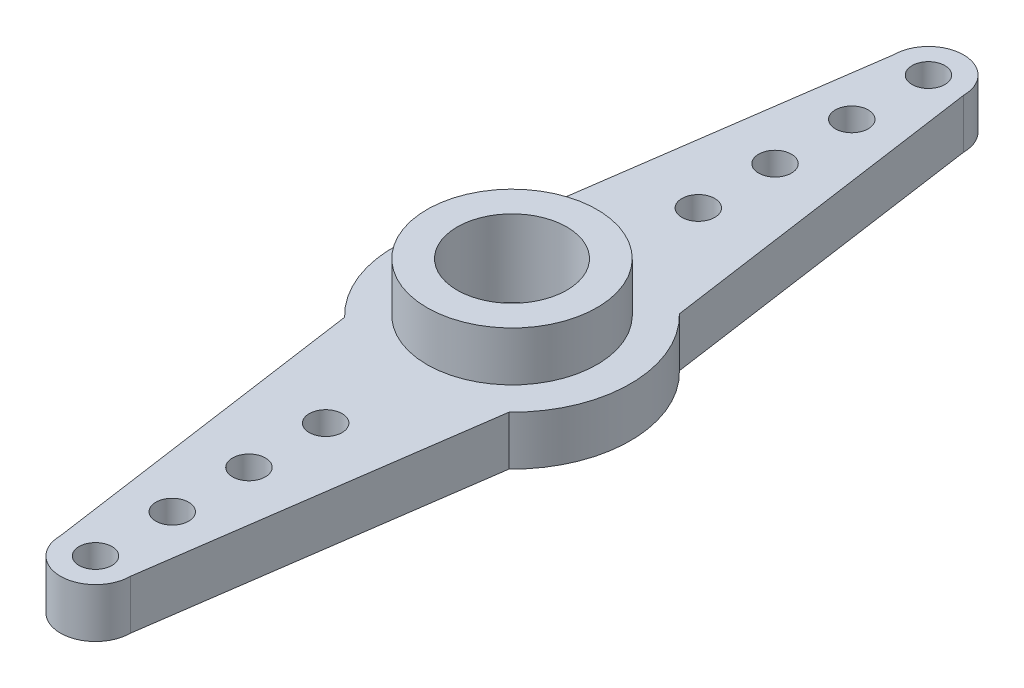
ISO-10303-21;
HEADER;
FILE_DESCRIPTION(('STEP AP214'),'2;1');
FILE_NAME('part.step','',(''),(''),'','','');
FILE_SCHEMA(('AUTOMOTIVE_DESIGN { 1 0 10303 214 1 1 1 1 }'));
ENDSEC;
DATA;
#1=APPLICATION_CONTEXT('core data for automotive mechanical design processes');
#2=APPLICATION_PROTOCOL_DEFINITION('international standard','automotive_design',2000,#1);
#3=PRODUCT_CONTEXT('',#1,'mechanical');
#4=PRODUCT('Part','Part','',(#3));
#5=PRODUCT_RELATED_PRODUCT_CATEGORY('part','',(#4));
#6=PRODUCT_DEFINITION_FORMATION('','',#4);
#7=PRODUCT_DEFINITION_CONTEXT('part definition',#1,'design');
#8=PRODUCT_DEFINITION('design','',#6,#7);
#9=PRODUCT_DEFINITION_SHAPE('','',#8);
#10=(LENGTH_UNIT() NAMED_UNIT(*) SI_UNIT(.MILLI.,.METRE.));
#11=(NAMED_UNIT(*) PLANE_ANGLE_UNIT() SI_UNIT($,.RADIAN.));
#12=(NAMED_UNIT(*) SI_UNIT($,.STERADIAN.) SOLID_ANGLE_UNIT());
#13=UNCERTAINTY_MEASURE_WITH_UNIT(LENGTH_MEASURE(1.E-05),#10,'distance_accuracy_value','');
#14=(GEOMETRIC_REPRESENTATION_CONTEXT(3) GLOBAL_UNCERTAINTY_ASSIGNED_CONTEXT((#13)) GLOBAL_UNIT_ASSIGNED_CONTEXT((#10,
#11,#12)) REPRESENTATION_CONTEXT('',''));
#15=CARTESIAN_POINT('',(0.,0.,0.));
#16=DIRECTION('',(0.,0.,1.));
#17=DIRECTION('',(1.,0.,0.));
#18=AXIS2_PLACEMENT_3D('',#15,#16,#17);
#19=CARTESIAN_POINT('',(0.,0.,0.));
#20=DIRECTION('',(0.,1.,0.));
#21=DIRECTION('',(0.,0.,1.));
#22=AXIS2_PLACEMENT_3D('',#19,#20,#21);
#23=PLANE('',#22);
#24=CARTESIAN_POINT('',(0.,0.,0.));
#25=DIRECTION('',(0.,-1.,0.));
#26=DIRECTION('',(0.,0.,-1.));
#27=AXIS2_PLACEMENT_3D('',#24,#25,#26);
#28=CIRCLE('',#27,2.00852796678638);
#29=CARTESIAN_POINT('',(0.,0.,-2.00852796678638));
#30=VERTEX_POINT('',#29);
#31=EDGE_CURVE('E257',#30,#30,#28,.T.);
#32=ORIENTED_EDGE('',*,*,#31,.F.);
#33=EDGE_LOOP('',(#32));
#34=FACE_BOUND('',#33,.T.);
#35=CARTESIAN_POINT('',(0.,0.,0.));
#36=DIRECTION('',(0.,-1.,0.));
#37=DIRECTION('',(0.,0.,-1.));
#38=AXIS2_PLACEMENT_3D('',#35,#36,#37);
#39=CIRCLE('',#38,3.);
#40=CARTESIAN_POINT('',(0.,0.,-3.));
#41=VERTEX_POINT('',#40);
#42=EDGE_CURVE('E269',#41,#41,#39,.T.);
#43=ORIENTED_EDGE('',*,*,#42,.T.);
#44=EDGE_LOOP('',(#43));
#45=FACE_BOUND('',#44,.T.);
#46=ADVANCED_FACE('F50',(#34,#45),#23,.F.);
#47=CARTESIAN_POINT('',(0.,2.25,0.));
#48=DIRECTION('',(0.,-1.,0.));
#49=DIRECTION('',(0.,0.,-1.));
#50=AXIS2_PLACEMENT_3D('',#47,#48,#49);
#51=CYLINDRICAL_SURFACE('',#50,2.5);
#52=CARTESIAN_POINT('',(0.,4.5,0.));
#53=DIRECTION('',(0.,1.,0.));
#54=DIRECTION('',(0.,0.,1.));
#55=AXIS2_PLACEMENT_3D('',#52,#53,#54);
#56=CIRCLE('',#55,2.5);
#57=CARTESIAN_POINT('',(0.,4.5,2.5));
#58=VERTEX_POINT('',#57);
#59=EDGE_CURVE('E248',#58,#58,#56,.T.);
#60=ORIENTED_EDGE('',*,*,#59,.T.);
#61=EDGE_LOOP('',(#60));
#62=FACE_BOUND('',#61,.T.);
#63=CARTESIAN_POINT('',(0.,1.,0.));
#64=DIRECTION('',(0.,-1.,0.));
#65=DIRECTION('',(0.,0.,-1.));
#66=AXIS2_PLACEMENT_3D('',#63,#64,#65);
#67=CIRCLE('',#66,2.5);
#68=CARTESIAN_POINT('',(0.,1.,-2.5));
#69=VERTEX_POINT('',#68);
#70=EDGE_CURVE('E253',#69,#69,#67,.T.);
#71=ORIENTED_EDGE('',*,*,#70,.T.);
#72=EDGE_LOOP('',(#71));
#73=FACE_BOUND('',#72,.T.);
#74=ADVANCED_FACE('F299',(#62,#73),#51,.F.);
#75=CARTESIAN_POINT('',(0.,2.25,0.));
#76=DIRECTION('',(0.,1.,0.));
#77=DIRECTION('',(0.,0.,1.));
#78=AXIS2_PLACEMENT_3D('',#75,#76,#77);
#79=PLANE('',#78);
#80=CARTESIAN_POINT('',(0.,2.25,8.5));
#81=DIRECTION('',(0.,1.,0.));
#82=DIRECTION('',(0.,0.,1.));
#83=AXIS2_PLACEMENT_3D('',#80,#81,#82);
#84=CIRCLE('',#83,0.75);
#85=CARTESIAN_POINT('',(0.,2.25,9.25));
#86=VERTEX_POINT('',#85);
#87=EDGE_CURVE('E236',#86,#86,#84,.T.);
#88=ORIENTED_EDGE('',*,*,#87,.F.);
#89=EDGE_LOOP('',(#88));
#90=FACE_BOUND('',#89,.T.);
#91=CARTESIAN_POINT('',(0.,2.25,15.5));
#92=DIRECTION('',(0.,1.,0.));
#93=DIRECTION('',(0.,0.,1.));
#94=AXIS2_PLACEMENT_3D('',#91,#92,#93);
#95=CIRCLE('',#94,0.750000000000001);
#96=CARTESIAN_POINT('',(0.,2.25,16.25));
#97=VERTEX_POINT('',#96);
#98=EDGE_CURVE('E224',#97,#97,#95,.T.);
#99=ORIENTED_EDGE('',*,*,#98,.F.);
#100=EDGE_LOOP('',(#99));
#101=FACE_BOUND('',#100,.T.);
#102=CARTESIAN_POINT('',(0.,2.25,-12.));
#103=DIRECTION('',(0.,1.,0.));
#104=DIRECTION('',(0.,0.,1.));
#105=AXIS2_PLACEMENT_3D('',#102,#103,#104);
#106=CIRCLE('',#105,0.75);
#107=CARTESIAN_POINT('',(0.,2.25,-11.25));
#108=VERTEX_POINT('',#107);
#109=EDGE_CURVE('E212',#108,#108,#106,.T.);
#110=ORIENTED_EDGE('',*,*,#109,.F.);
#111=EDGE_LOOP('',(#110));
#112=FACE_BOUND('',#111,.T.);
#113=CARTESIAN_POINT('',(0.,2.25,-19.));
#114=DIRECTION('',(0.,1.,0.));
#115=DIRECTION('',(0.,0.,1.));
#116=AXIS2_PLACEMENT_3D('',#113,#114,#115);
#117=CIRCLE('',#116,0.75);
#118=CARTESIAN_POINT('',(0.,2.25,-18.25));
#119=VERTEX_POINT('',#118);
#120=EDGE_CURVE('E200',#119,#119,#117,.T.);
#121=ORIENTED_EDGE('',*,*,#120,.F.);
#122=EDGE_LOOP('',(#121));
#123=FACE_BOUND('',#122,.T.);
#124=CARTESIAN_POINT('',(0.,2.25,0.));
#125=DIRECTION('',(0.,1.,0.));
#126=DIRECTION('',(0.,0.,1.));
#127=AXIS2_PLACEMENT_3D('',#124,#125,#126);
#128=CIRCLE('',#127,5.4);
#129=CARTESIAN_POINT('',(-3.75,2.25,-3.88555015409659));
#130=VERTEX_POINT('',#129);
#131=CARTESIAN_POINT('',(-3.75,2.25,3.88555015409659));
#132=VERTEX_POINT('',#131);
#133=EDGE_CURVE('E163',#130,#132,#128,.T.);
#134=ORIENTED_EDGE('',*,*,#133,.T.);
#135=DIRECTION('',(0.140830303687938,0.,0.990033749709152));
#136=VECTOR('',#135,1.);
#137=CARTESIAN_POINT('',(-3.75,2.25,3.88555015409659));
#138=LINE('',#137,#136);
#139=CARTESIAN_POINT('',(-1.6,2.25,19.));
#140=VERTEX_POINT('',#139);
#141=EDGE_CURVE('E110',#132,#140,#138,.T.);
#142=ORIENTED_EDGE('',*,*,#141,.T.);
#143=CARTESIAN_POINT('',(0.,2.25,19.));
#144=DIRECTION('',(0.,1.,0.));
#145=DIRECTION('',(0.,0.,1.));
#146=AXIS2_PLACEMENT_3D('',#143,#144,#145);
#147=CIRCLE('',#146,1.6);
#148=CARTESIAN_POINT('',(1.6,2.25,19.));
#149=VERTEX_POINT('',#148);
#150=EDGE_CURVE('E178',#140,#149,#147,.T.);
#151=ORIENTED_EDGE('',*,*,#150,.T.);
#152=DIRECTION('',(0.140830303687937,0.,-0.990033749709152));
#153=VECTOR('',#152,1.);
#154=CARTESIAN_POINT('',(1.6,2.25,19.));
#155=LINE('',#154,#153);
#156=CARTESIAN_POINT('',(3.75,2.25,3.88555015409659));
#157=VERTEX_POINT('',#156);
#158=EDGE_CURVE('E191',#149,#157,#155,.T.);
#159=ORIENTED_EDGE('',*,*,#158,.T.);
#160=CARTESIAN_POINT('',(0.,2.25,0.));
#161=DIRECTION('',(0.,1.,0.));
#162=DIRECTION('',(0.,0.,1.));
#163=AXIS2_PLACEMENT_3D('',#160,#161,#162);
#164=CIRCLE('',#163,5.4);
#165=CARTESIAN_POINT('',(3.75,2.25,-3.88555015409659));
#166=VERTEX_POINT('',#165);
#167=EDGE_CURVE('E130',#157,#166,#164,.T.);
#168=ORIENTED_EDGE('',*,*,#167,.T.);
#169=DIRECTION('',(-0.140830303687937,0.,-0.990033749709152));
#170=VECTOR('',#169,1.);
#171=CARTESIAN_POINT('',(1.6,2.25,-19.));
#172=LINE('',#171,#170);
#173=CARTESIAN_POINT('',(1.6,2.25,-19.));
#174=VERTEX_POINT('',#173);
#175=EDGE_CURVE('E123',#166,#174,#172,.T.);
#176=ORIENTED_EDGE('',*,*,#175,.T.);
#177=CARTESIAN_POINT('',(0.,2.25,-19.));
#178=DIRECTION('',(0.,1.,0.));
#179=DIRECTION('',(0.,0.,1.));
#180=AXIS2_PLACEMENT_3D('',#177,#178,#179);
#181=CIRCLE('',#180,1.6);
#182=CARTESIAN_POINT('',(-1.6,2.25,-19.));
#183=VERTEX_POINT('',#182);
#184=EDGE_CURVE('E128',#174,#183,#181,.T.);
#185=ORIENTED_EDGE('',*,*,#184,.T.);
#186=DIRECTION('',(-0.140830303687937,0.,0.990033749709152));
#187=VECTOR('',#186,1.);
#188=CARTESIAN_POINT('',(-1.6,2.25,-19.));
#189=LINE('',#188,#187);
#190=EDGE_CURVE('E67',#183,#130,#189,.T.);
#191=ORIENTED_EDGE('',*,*,#190,.T.);
#192=EDGE_LOOP('',(#134,#142,#151,#159,#168,#176,#185,#191));
#193=FACE_BOUND('',#192,.T.);
#194=CARTESIAN_POINT('',(0.,2.25,19.));
#195=DIRECTION('',(0.,1.,0.));
#196=DIRECTION('',(0.,0.,1.));
#197=AXIS2_PLACEMENT_3D('',#194,#195,#196);
#198=CIRCLE('',#197,0.75);
#199=CARTESIAN_POINT('',(0.,2.25,19.75));
#200=VERTEX_POINT('',#199);
#201=EDGE_CURVE('E152',#200,#200,#198,.T.);
#202=ORIENTED_EDGE('',*,*,#201,.F.);
#203=EDGE_LOOP('',(#202));
#204=FACE_BOUND('',#203,.T.);
#205=CARTESIAN_POINT('',(0.,2.25,-15.5));
#206=DIRECTION('',(0.,1.,0.));
#207=DIRECTION('',(0.,0.,1.));
#208=AXIS2_PLACEMENT_3D('',#205,#206,#207);
#209=CIRCLE('',#208,0.75);
#210=CARTESIAN_POINT('',(0.,2.25,-14.75));
#211=VERTEX_POINT('',#210);
#212=EDGE_CURVE('E206',#211,#211,#209,.T.);
#213=ORIENTED_EDGE('',*,*,#212,.F.);
#214=EDGE_LOOP('',(#213));
#215=FACE_BOUND('',#214,.T.);
#216=CARTESIAN_POINT('',(0.,2.25,-8.5));
#217=DIRECTION('',(0.,1.,0.));
#218=DIRECTION('',(0.,0.,1.));
#219=AXIS2_PLACEMENT_3D('',#216,#217,#218);
#220=CIRCLE('',#219,0.75);
#221=CARTESIAN_POINT('',(0.,2.25,-7.75));
#222=VERTEX_POINT('',#221);
#223=EDGE_CURVE('E218',#222,#222,#220,.T.);
#224=ORIENTED_EDGE('',*,*,#223,.F.);
#225=EDGE_LOOP('',(#224));
#226=FACE_BOUND('',#225,.T.);
#227=CARTESIAN_POINT('',(0.,2.25,12.));
#228=DIRECTION('',(0.,1.,0.));
#229=DIRECTION('',(0.,0.,1.));
#230=AXIS2_PLACEMENT_3D('',#227,#228,#229);
#231=CIRCLE('',#230,0.750000000000001);
#232=CARTESIAN_POINT('',(0.,2.25,12.75));
#233=VERTEX_POINT('',#232);
#234=EDGE_CURVE('E230',#233,#233,#231,.T.);
#235=ORIENTED_EDGE('',*,*,#234,.F.);
#236=EDGE_LOOP('',(#235));
#237=FACE_BOUND('',#236,.T.);
#238=CARTESIAN_POINT('',(0.,2.25,0.));
#239=DIRECTION('',(0.,1.,0.));
#240=DIRECTION('',(0.,0.,1.));
#241=AXIS2_PLACEMENT_3D('',#238,#239,#240);
#242=CIRCLE('',#241,3.87950189537483);
#243=CARTESIAN_POINT('',(0.,2.25,3.87950189537483));
#244=VERTEX_POINT('',#243);
#245=EDGE_CURVE('E245',#244,#244,#242,.T.);
#246=ORIENTED_EDGE('',*,*,#245,.F.);
#247=EDGE_LOOP('',(#246));
#248=FACE_BOUND('',#247,.T.);
#249=ADVANCED_FACE('F125',(#90,#101,#112,#123,#193,#204,#215,#226,#237,#248),#79,.T.);
#250=CARTESIAN_POINT('',(0.,0.,0.));
#251=DIRECTION('',(0.,-1.,0.));
#252=DIRECTION('',(0.,0.,-1.));
#253=AXIS2_PLACEMENT_3D('',#250,#251,#252);
#254=CIRCLE('',#253,3.8);
#255=CARTESIAN_POINT('',(0.,0.,-3.8));
#256=VERTEX_POINT('',#255);
#257=EDGE_CURVE('E263',#256,#256,#254,.T.);
#258=ORIENTED_EDGE('',*,*,#257,.F.);
#259=EDGE_LOOP('',(#258));
#260=FACE_BOUND('',#259,.T.);
#261=CARTESIAN_POINT('',(0.,0.,0.));
#262=DIRECTION('',(0.,1.,0.));
#263=DIRECTION('',(0.,0.,1.));
#264=AXIS2_PLACEMENT_3D('',#261,#262,#263);
#265=CIRCLE('',#264,5.4);
#266=CARTESIAN_POINT('',(-3.75,0.,-3.88555015409659));
#267=VERTEX_POINT('',#266);
#268=CARTESIAN_POINT('',(-3.75,0.,3.88555015409659));
#269=VERTEX_POINT('',#268);
#270=EDGE_CURVE('E148',#267,#269,#265,.T.);
#271=ORIENTED_EDGE('',*,*,#270,.F.);
#272=DIRECTION('',(-0.140830303687937,0.,0.990033749709152));
#273=VECTOR('',#272,1.);
#274=CARTESIAN_POINT('',(-1.6,0.,-19.));
#275=LINE('',#274,#273);
#276=CARTESIAN_POINT('',(-1.6,0.,-19.));
#277=VERTEX_POINT('',#276);
#278=EDGE_CURVE('E102',#277,#267,#275,.T.);
#279=ORIENTED_EDGE('',*,*,#278,.F.);
#280=CARTESIAN_POINT('',(0.,0.,-19.));
#281=DIRECTION('',(0.,1.,0.));
#282=DIRECTION('',(0.,0.,1.));
#283=AXIS2_PLACEMENT_3D('',#280,#281,#282);
#284=CIRCLE('',#283,1.6);
#285=CARTESIAN_POINT('',(1.6,0.,-19.));
#286=VERTEX_POINT('',#285);
#287=EDGE_CURVE('E96',#286,#277,#284,.T.);
#288=ORIENTED_EDGE('',*,*,#287,.F.);
#289=DIRECTION('',(-0.140830303687937,0.,-0.990033749709152));
#290=VECTOR('',#289,1.);
#291=CARTESIAN_POINT('',(1.6,0.,-19.));
#292=LINE('',#291,#290);
#293=CARTESIAN_POINT('',(3.75,0.,-3.88555015409659));
#294=VERTEX_POINT('',#293);
#295=EDGE_CURVE('E138',#294,#286,#292,.T.);
#296=ORIENTED_EDGE('',*,*,#295,.F.);
#297=CARTESIAN_POINT('',(0.,0.,0.));
#298=DIRECTION('',(0.,1.,0.));
#299=DIRECTION('',(0.,0.,1.));
#300=AXIS2_PLACEMENT_3D('',#297,#298,#299);
#301=CIRCLE('',#300,5.4);
#302=CARTESIAN_POINT('',(3.75,0.,3.88555015409659));
#303=VERTEX_POINT('',#302);
#304=EDGE_CURVE('E158',#303,#294,#301,.T.);
#305=ORIENTED_EDGE('',*,*,#304,.F.);
#306=DIRECTION('',(0.140830303687937,0.,-0.990033749709152));
#307=VECTOR('',#306,1.);
#308=CARTESIAN_POINT('',(1.6,0.,19.));
#309=LINE('',#308,#307);
#310=CARTESIAN_POINT('',(1.6,0.,19.));
#311=VERTEX_POINT('',#310);
#312=EDGE_CURVE('E156',#311,#303,#309,.T.);
#313=ORIENTED_EDGE('',*,*,#312,.F.);
#314=CARTESIAN_POINT('',(0.,0.,19.));
#315=DIRECTION('',(0.,1.,0.));
#316=DIRECTION('',(0.,0.,1.));
#317=AXIS2_PLACEMENT_3D('',#314,#315,#316);
#318=CIRCLE('',#317,1.6);
#319=CARTESIAN_POINT('',(-1.6,0.,19.));
#320=VERTEX_POINT('',#319);
#321=EDGE_CURVE('E154',#320,#311,#318,.T.);
#322=ORIENTED_EDGE('',*,*,#321,.F.);
#323=DIRECTION('',(0.140830303687938,0.,0.990033749709152));
#324=VECTOR('',#323,1.);
#325=CARTESIAN_POINT('',(-3.75,0.,3.88555015409659));
#326=LINE('',#325,#324);
#327=EDGE_CURVE('E151',#269,#320,#326,.T.);
#328=ORIENTED_EDGE('',*,*,#327,.F.);
#329=EDGE_LOOP('',(#271,#279,#288,#296,#305,#313,#322,#328));
#330=FACE_BOUND('',#329,.T.);
#331=CARTESIAN_POINT('',(0.,0.,19.));
#332=DIRECTION('',(0.,1.,0.));
#333=DIRECTION('',(0.,0.,1.));
#334=AXIS2_PLACEMENT_3D('',#331,#332,#333);
#335=CIRCLE('',#334,0.75);
#336=CARTESIAN_POINT('',(0.,0.,19.75));
#337=VERTEX_POINT('',#336);
#338=EDGE_CURVE('E197',#337,#337,#335,.T.);
#339=ORIENTED_EDGE('',*,*,#338,.T.);
#340=EDGE_LOOP('',(#339));
#341=FACE_BOUND('',#340,.T.);
#342=CARTESIAN_POINT('',(0.,0.,-19.));
#343=DIRECTION('',(0.,1.,0.));
#344=DIRECTION('',(0.,0.,1.));
#345=AXIS2_PLACEMENT_3D('',#342,#343,#344);
#346=CIRCLE('',#345,0.75);
#347=CARTESIAN_POINT('',(0.,0.,-18.25));
#348=VERTEX_POINT('',#347);
#349=EDGE_CURVE('E203',#348,#348,#346,.T.);
#350=ORIENTED_EDGE('',*,*,#349,.T.);
#351=EDGE_LOOP('',(#350));
#352=FACE_BOUND('',#351,.T.);
#353=CARTESIAN_POINT('',(0.,0.,-15.5));
#354=DIRECTION('',(0.,1.,0.));
#355=DIRECTION('',(0.,0.,1.));
#356=AXIS2_PLACEMENT_3D('',#353,#354,#355);
#357=CIRCLE('',#356,0.75);
#358=CARTESIAN_POINT('',(0.,0.,-14.75));
#359=VERTEX_POINT('',#358);
#360=EDGE_CURVE('E209',#359,#359,#357,.T.);
#361=ORIENTED_EDGE('',*,*,#360,.T.);
#362=EDGE_LOOP('',(#361));
#363=FACE_BOUND('',#362,.T.);
#364=CARTESIAN_POINT('',(0.,0.,-12.));
#365=DIRECTION('',(0.,1.,0.));
#366=DIRECTION('',(0.,0.,1.));
#367=AXIS2_PLACEMENT_3D('',#364,#365,#366);
#368=CIRCLE('',#367,0.75);
#369=CARTESIAN_POINT('',(0.,0.,-11.25));
#370=VERTEX_POINT('',#369);
#371=EDGE_CURVE('E215',#370,#370,#368,.T.);
#372=ORIENTED_EDGE('',*,*,#371,.T.);
#373=EDGE_LOOP('',(#372));
#374=FACE_BOUND('',#373,.T.);
#375=CARTESIAN_POINT('',(0.,0.,-8.5));
#376=DIRECTION('',(0.,1.,0.));
#377=DIRECTION('',(0.,0.,1.));
#378=AXIS2_PLACEMENT_3D('',#375,#376,#377);
#379=CIRCLE('',#378,0.75);
#380=CARTESIAN_POINT('',(0.,0.,-7.75));
#381=VERTEX_POINT('',#380);
#382=EDGE_CURVE('E221',#381,#381,#379,.T.);
#383=ORIENTED_EDGE('',*,*,#382,.T.);
#384=EDGE_LOOP('',(#383));
#385=FACE_BOUND('',#384,.T.);
#386=CARTESIAN_POINT('',(0.,0.,15.5));
#387=DIRECTION('',(0.,1.,0.));
#388=DIRECTION('',(0.,0.,1.));
#389=AXIS2_PLACEMENT_3D('',#386,#387,#388);
#390=CIRCLE('',#389,0.750000000000001);
#391=CARTESIAN_POINT('',(0.,0.,16.25));
#392=VERTEX_POINT('',#391);
#393=EDGE_CURVE('E227',#392,#392,#390,.T.);
#394=ORIENTED_EDGE('',*,*,#393,.T.);
#395=EDGE_LOOP('',(#394));
#396=FACE_BOUND('',#395,.T.);
#397=CARTESIAN_POINT('',(0.,0.,12.));
#398=DIRECTION('',(0.,1.,0.));
#399=DIRECTION('',(0.,0.,1.));
#400=AXIS2_PLACEMENT_3D('',#397,#398,#399);
#401=CIRCLE('',#400,0.750000000000001);
#402=CARTESIAN_POINT('',(0.,0.,12.75));
#403=VERTEX_POINT('',#402);
#404=EDGE_CURVE('E233',#403,#403,#401,.T.);
#405=ORIENTED_EDGE('',*,*,#404,.T.);
#406=EDGE_LOOP('',(#405));
#407=FACE_BOUND('',#406,.T.);
#408=CARTESIAN_POINT('',(0.,0.,8.5));
#409=DIRECTION('',(0.,1.,0.));
#410=DIRECTION('',(0.,0.,1.));
#411=AXIS2_PLACEMENT_3D('',#408,#409,#410);
#412=CIRCLE('',#411,0.75);
#413=CARTESIAN_POINT('',(0.,0.,9.25));
#414=VERTEX_POINT('',#413);
#415=EDGE_CURVE('E239',#414,#414,#412,.T.);
#416=ORIENTED_EDGE('',*,*,#415,.T.);
#417=EDGE_LOOP('',(#416));
#418=FACE_BOUND('',#417,.T.);
#419=ADVANCED_FACE('F182',(#260,#330,#341,#352,#363,#374,#385,#396,#407,#418),#23,.F.);
#420=CARTESIAN_POINT('',(0.,2.25,0.));
#421=DIRECTION('',(0.,-1.,0.));
#422=DIRECTION('',(0.,0.,-1.));
#423=AXIS2_PLACEMENT_3D('',#420,#421,#422);
#424=CYLINDRICAL_SURFACE('',#423,5.4);
#425=ORIENTED_EDGE('',*,*,#270,.T.);
#426=DIRECTION('',(0.,-1.,0.));
#427=VECTOR('',#426,1.);
#428=CARTESIAN_POINT('',(-3.75,2.25,3.88555015409659));
#429=LINE('',#428,#427);
#430=EDGE_CURVE('E13',#132,#269,#429,.T.);
#431=ORIENTED_EDGE('',*,*,#430,.F.);
#432=ORIENTED_EDGE('',*,*,#133,.F.);
#433=DIRECTION('',(0.,-1.,0.));
#434=VECTOR('',#433,1.);
#435=CARTESIAN_POINT('',(-3.75,2.25,-3.88555015409659));
#436=LINE('',#435,#434);
#437=EDGE_CURVE('E144',#130,#267,#436,.T.);
#438=ORIENTED_EDGE('',*,*,#437,.T.);
#439=EDGE_LOOP('',(#425,#431,#432,#438));
#440=FACE_BOUND('',#439,.T.);
#441=ADVANCED_FACE('F52',(#440),#424,.T.);
#442=CARTESIAN_POINT('',(-3.75,2.25,3.88555015409659));
#443=DIRECTION('',(0.990033749709152,0.,-0.140830303687938));
#444=DIRECTION('',(-0.140830303687938,0.,-0.990033749709152));
#445=AXIS2_PLACEMENT_3D('',#442,#443,#444);
#446=PLANE('',#445);
#447=ORIENTED_EDGE('',*,*,#327,.T.);
#448=DIRECTION('',(0.,-1.,0.));
#449=VECTOR('',#448,1.);
#450=CARTESIAN_POINT('',(-1.6,2.25,19.));
#451=LINE('',#450,#449);
#452=EDGE_CURVE('E59',#140,#320,#451,.T.);
#453=ORIENTED_EDGE('',*,*,#452,.F.);
#454=ORIENTED_EDGE('',*,*,#141,.F.);
#455=ORIENTED_EDGE('',*,*,#430,.T.);
#456=EDGE_LOOP('',(#447,#453,#454,#455));
#457=FACE_BOUND('',#456,.T.);
#458=ADVANCED_FACE('F297',(#457),#446,.F.);
#459=CARTESIAN_POINT('',(0.,2.25,19.));
#460=DIRECTION('',(0.,-1.,0.));
#461=DIRECTION('',(0.,0.,-1.));
#462=AXIS2_PLACEMENT_3D('',#459,#460,#461);
#463=CYLINDRICAL_SURFACE('',#462,1.6);
#464=ORIENTED_EDGE('',*,*,#321,.T.);
#465=DIRECTION('',(0.,-1.,0.));
#466=VECTOR('',#465,1.);
#467=CARTESIAN_POINT('',(1.6,2.25,19.));
#468=LINE('',#467,#466);
#469=EDGE_CURVE('E170',#149,#311,#468,.T.);
#470=ORIENTED_EDGE('',*,*,#469,.F.);
#471=ORIENTED_EDGE('',*,*,#150,.F.);
#472=ORIENTED_EDGE('',*,*,#452,.T.);
#473=EDGE_LOOP('',(#464,#470,#471,#472));
#474=FACE_BOUND('',#473,.T.);
#475=ADVANCED_FACE('F176',(#474),#463,.T.);
#476=CARTESIAN_POINT('',(1.6,2.25,19.));
#477=DIRECTION('',(-0.990033749709152,0.,-0.140830303687937));
#478=DIRECTION('',(-0.140830303687937,0.,0.990033749709152));
#479=AXIS2_PLACEMENT_3D('',#476,#477,#478);
#480=PLANE('',#479);
#481=ORIENTED_EDGE('',*,*,#312,.T.);
#482=DIRECTION('',(0.,-1.,0.));
#483=VECTOR('',#482,1.);
#484=CARTESIAN_POINT('',(3.75,2.25,3.88555015409659));
#485=LINE('',#484,#483);
#486=EDGE_CURVE('E167',#157,#303,#485,.T.);
#487=ORIENTED_EDGE('',*,*,#486,.F.);
#488=ORIENTED_EDGE('',*,*,#158,.F.);
#489=ORIENTED_EDGE('',*,*,#469,.T.);
#490=EDGE_LOOP('',(#481,#487,#488,#489));
#491=FACE_BOUND('',#490,.T.);
#492=ADVANCED_FACE('F187',(#491),#480,.F.);
#493=CARTESIAN_POINT('',(0.,2.25,0.));
#494=DIRECTION('',(0.,-1.,0.));
#495=DIRECTION('',(0.,0.,-1.));
#496=AXIS2_PLACEMENT_3D('',#493,#494,#495);
#497=CYLINDRICAL_SURFACE('',#496,5.4);
#498=ORIENTED_EDGE('',*,*,#304,.T.);
#499=DIRECTION('',(0.,-1.,0.));
#500=VECTOR('',#499,1.);
#501=CARTESIAN_POINT('',(3.75,2.25,-3.88555015409659));
#502=LINE('',#501,#500);
#503=EDGE_CURVE('E139',#166,#294,#502,.T.);
#504=ORIENTED_EDGE('',*,*,#503,.F.);
#505=ORIENTED_EDGE('',*,*,#167,.F.);
#506=ORIENTED_EDGE('',*,*,#486,.T.);
#507=EDGE_LOOP('',(#498,#504,#505,#506));
#508=FACE_BOUND('',#507,.T.);
#509=ADVANCED_FACE('F190',(#508),#497,.T.);
#510=CARTESIAN_POINT('',(1.6,2.25,-19.));
#511=DIRECTION('',(-0.990033749709152,0.,0.140830303687937));
#512=DIRECTION('',(0.140830303687937,0.,0.990033749709152));
#513=AXIS2_PLACEMENT_3D('',#510,#511,#512);
#514=PLANE('',#513);
#515=ORIENTED_EDGE('',*,*,#295,.T.);
#516=DIRECTION('',(0.,-1.,0.));
#517=VECTOR('',#516,1.);
#518=CARTESIAN_POINT('',(1.6,2.25,-19.));
#519=LINE('',#518,#517);
#520=EDGE_CURVE('E135',#174,#286,#519,.T.);
#521=ORIENTED_EDGE('',*,*,#520,.F.);
#522=ORIENTED_EDGE('',*,*,#175,.F.);
#523=ORIENTED_EDGE('',*,*,#503,.T.);
#524=EDGE_LOOP('',(#515,#521,#522,#523));
#525=FACE_BOUND('',#524,.T.);
#526=ADVANCED_FACE('F136',(#525),#514,.F.);
#527=CARTESIAN_POINT('',(0.,2.25,-19.));
#528=DIRECTION('',(0.,-1.,0.));
#529=DIRECTION('',(0.,0.,-1.));
#530=AXIS2_PLACEMENT_3D('',#527,#528,#529);
#531=CYLINDRICAL_SURFACE('',#530,1.6);
#532=ORIENTED_EDGE('',*,*,#287,.T.);
#533=DIRECTION('',(0.,-1.,0.));
#534=VECTOR('',#533,1.);
#535=CARTESIAN_POINT('',(-1.6,2.25,-19.));
#536=LINE('',#535,#534);
#537=EDGE_CURVE('E140',#183,#277,#536,.T.);
#538=ORIENTED_EDGE('',*,*,#537,.F.);
#539=ORIENTED_EDGE('',*,*,#184,.F.);
#540=ORIENTED_EDGE('',*,*,#520,.T.);
#541=EDGE_LOOP('',(#532,#538,#539,#540));
#542=FACE_BOUND('',#541,.T.);
#543=ADVANCED_FACE('F142',(#542),#531,.T.);
#544=CARTESIAN_POINT('',(-1.6,2.25,-19.));
#545=DIRECTION('',(0.990033749709152,0.,0.140830303687937));
#546=DIRECTION('',(0.140830303687937,0.,-0.990033749709152));
#547=AXIS2_PLACEMENT_3D('',#544,#545,#546);
#548=PLANE('',#547);
#549=ORIENTED_EDGE('',*,*,#278,.T.);
#550=ORIENTED_EDGE('',*,*,#437,.F.);
#551=ORIENTED_EDGE('',*,*,#190,.F.);
#552=ORIENTED_EDGE('',*,*,#537,.T.);
#553=EDGE_LOOP('',(#549,#550,#551,#552));
#554=FACE_BOUND('',#553,.T.);
#555=ADVANCED_FACE('F363',(#554),#548,.F.);
#556=CARTESIAN_POINT('',(0.,2.25,19.));
#557=DIRECTION('',(0.,-1.,0.));
#558=DIRECTION('',(0.,0.,-1.));
#559=AXIS2_PLACEMENT_3D('',#556,#557,#558);
#560=CYLINDRICAL_SURFACE('',#559,0.75);
#561=ORIENTED_EDGE('',*,*,#201,.T.);
#562=EDGE_LOOP('',(#561));
#563=FACE_BOUND('',#562,.T.);
#564=ORIENTED_EDGE('',*,*,#338,.F.);
#565=EDGE_LOOP('',(#564));
#566=FACE_BOUND('',#565,.T.);
#567=ADVANCED_FACE('F360',(#563,#566),#560,.F.);
#568=CARTESIAN_POINT('',(0.,2.25,-19.));
#569=DIRECTION('',(0.,-1.,0.));
#570=DIRECTION('',(0.,0.,-1.));
#571=AXIS2_PLACEMENT_3D('',#568,#569,#570);
#572=CYLINDRICAL_SURFACE('',#571,0.75);
#573=ORIENTED_EDGE('',*,*,#120,.T.);
#574=EDGE_LOOP('',(#573));
#575=FACE_BOUND('',#574,.T.);
#576=ORIENTED_EDGE('',*,*,#349,.F.);
#577=EDGE_LOOP('',(#576));
#578=FACE_BOUND('',#577,.T.);
#579=ADVANCED_FACE('F356',(#575,#578),#572,.F.);
#580=CARTESIAN_POINT('',(0.,2.25,-15.5));
#581=DIRECTION('',(0.,-1.,0.));
#582=DIRECTION('',(0.,0.,-1.));
#583=AXIS2_PLACEMENT_3D('',#580,#581,#582);
#584=CYLINDRICAL_SURFACE('',#583,0.75);
#585=ORIENTED_EDGE('',*,*,#212,.T.);
#586=EDGE_LOOP('',(#585));
#587=FACE_BOUND('',#586,.T.);
#588=ORIENTED_EDGE('',*,*,#360,.F.);
#589=EDGE_LOOP('',(#588));
#590=FACE_BOUND('',#589,.T.);
#591=ADVANCED_FACE('F352',(#587,#590),#584,.F.);
#592=CARTESIAN_POINT('',(0.,2.25,-12.));
#593=DIRECTION('',(0.,-1.,0.));
#594=DIRECTION('',(0.,0.,-1.));
#595=AXIS2_PLACEMENT_3D('',#592,#593,#594);
#596=CYLINDRICAL_SURFACE('',#595,0.75);
#597=ORIENTED_EDGE('',*,*,#109,.T.);
#598=EDGE_LOOP('',(#597));
#599=FACE_BOUND('',#598,.T.);
#600=ORIENTED_EDGE('',*,*,#371,.F.);
#601=EDGE_LOOP('',(#600));
#602=FACE_BOUND('',#601,.T.);
#603=ADVANCED_FACE('F348',(#599,#602),#596,.F.);
#604=CARTESIAN_POINT('',(0.,2.25,-8.5));
#605=DIRECTION('',(0.,-1.,0.));
#606=DIRECTION('',(0.,0.,-1.));
#607=AXIS2_PLACEMENT_3D('',#604,#605,#606);
#608=CYLINDRICAL_SURFACE('',#607,0.75);
#609=ORIENTED_EDGE('',*,*,#223,.T.);
#610=EDGE_LOOP('',(#609));
#611=FACE_BOUND('',#610,.T.);
#612=ORIENTED_EDGE('',*,*,#382,.F.);
#613=EDGE_LOOP('',(#612));
#614=FACE_BOUND('',#613,.T.);
#615=ADVANCED_FACE('F344',(#611,#614),#608,.F.);
#616=CARTESIAN_POINT('',(0.,2.25,15.5));
#617=DIRECTION('',(0.,-1.,0.));
#618=DIRECTION('',(0.,0.,-1.));
#619=AXIS2_PLACEMENT_3D('',#616,#617,#618);
#620=CYLINDRICAL_SURFACE('',#619,0.750000000000001);
#621=ORIENTED_EDGE('',*,*,#98,.T.);
#622=EDGE_LOOP('',(#621));
#623=FACE_BOUND('',#622,.T.);
#624=ORIENTED_EDGE('',*,*,#393,.F.);
#625=EDGE_LOOP('',(#624));
#626=FACE_BOUND('',#625,.T.);
#627=ADVANCED_FACE('F340',(#623,#626),#620,.F.);
#628=CARTESIAN_POINT('',(0.,2.25,12.));
#629=DIRECTION('',(0.,-1.,0.));
#630=DIRECTION('',(0.,0.,-1.));
#631=AXIS2_PLACEMENT_3D('',#628,#629,#630);
#632=CYLINDRICAL_SURFACE('',#631,0.750000000000001);
#633=ORIENTED_EDGE('',*,*,#234,.T.);
#634=EDGE_LOOP('',(#633));
#635=FACE_BOUND('',#634,.T.);
#636=ORIENTED_EDGE('',*,*,#404,.F.);
#637=EDGE_LOOP('',(#636));
#638=FACE_BOUND('',#637,.T.);
#639=ADVANCED_FACE('F336',(#635,#638),#632,.F.);
#640=CARTESIAN_POINT('',(0.,2.25,8.5));
#641=DIRECTION('',(0.,-1.,0.));
#642=DIRECTION('',(0.,0.,-1.));
#643=AXIS2_PLACEMENT_3D('',#640,#641,#642);
#644=CYLINDRICAL_SURFACE('',#643,0.75);
#645=ORIENTED_EDGE('',*,*,#87,.T.);
#646=EDGE_LOOP('',(#645));
#647=FACE_BOUND('',#646,.T.);
#648=ORIENTED_EDGE('',*,*,#415,.F.);
#649=EDGE_LOOP('',(#648));
#650=FACE_BOUND('',#649,.T.);
#651=ADVANCED_FACE('F329',(#647,#650),#644,.F.);
#652=CARTESIAN_POINT('',(0.,4.5,0.));
#653=DIRECTION('',(0.,1.,0.));
#654=DIRECTION('',(0.,0.,1.));
#655=AXIS2_PLACEMENT_3D('',#652,#653,#654);
#656=PLANE('',#655);
#657=CARTESIAN_POINT('',(0.,4.5,0.));
#658=DIRECTION('',(0.,1.,0.));
#659=DIRECTION('',(0.,0.,1.));
#660=AXIS2_PLACEMENT_3D('',#657,#658,#659);
#661=CIRCLE('',#660,3.87950189537483);
#662=CARTESIAN_POINT('',(0.,4.5,3.87950189537483));
#663=VERTEX_POINT('',#662);
#664=EDGE_CURVE('E242',#663,#663,#661,.T.);
#665=ORIENTED_EDGE('',*,*,#664,.T.);
#666=EDGE_LOOP('',(#665));
#667=FACE_BOUND('',#666,.T.);
#668=ORIENTED_EDGE('',*,*,#59,.F.);
#669=EDGE_LOOP('',(#668));
#670=FACE_BOUND('',#669,.T.);
#671=ADVANCED_FACE('F326',(#667,#670),#656,.T.);
#672=CARTESIAN_POINT('',(0.,4.5,0.));
#673=DIRECTION('',(0.,-1.,0.));
#674=DIRECTION('',(0.,0.,-1.));
#675=AXIS2_PLACEMENT_3D('',#672,#673,#674);
#676=CYLINDRICAL_SURFACE('',#675,3.87950189537483);
#677=ORIENTED_EDGE('',*,*,#664,.F.);
#678=EDGE_LOOP('',(#677));
#679=FACE_BOUND('',#678,.T.);
#680=ORIENTED_EDGE('',*,*,#245,.T.);
#681=EDGE_LOOP('',(#680));
#682=FACE_BOUND('',#681,.T.);
#683=ADVANCED_FACE('F324',(#679,#682),#676,.T.);
#684=CARTESIAN_POINT('',(0.,1.,0.));
#685=DIRECTION('',(0.,-1.,0.));
#686=DIRECTION('',(0.,0.,-1.));
#687=AXIS2_PLACEMENT_3D('',#684,#685,#686);
#688=PLANE('',#687);
#689=CARTESIAN_POINT('',(0.,1.,0.));
#690=DIRECTION('',(0.,-1.,0.));
#691=DIRECTION('',(0.,0.,-1.));
#692=AXIS2_PLACEMENT_3D('',#689,#690,#691);
#693=CIRCLE('',#692,2.00852796678638);
#694=CARTESIAN_POINT('',(0.,1.,-2.00852796678638));
#695=VERTEX_POINT('',#694);
#696=EDGE_CURVE('E256',#695,#695,#693,.T.);
#697=ORIENTED_EDGE('',*,*,#696,.T.);
#698=EDGE_LOOP('',(#697));
#699=FACE_BOUND('',#698,.T.);
#700=ORIENTED_EDGE('',*,*,#70,.F.);
#701=EDGE_LOOP('',(#700));
#702=FACE_BOUND('',#701,.T.);
#703=ADVANCED_FACE('F320',(#699,#702),#688,.F.);
#704=CARTESIAN_POINT('',(0.,1.,0.));
#705=DIRECTION('',(0.,-1.,0.));
#706=DIRECTION('',(0.,0.,-1.));
#707=AXIS2_PLACEMENT_3D('',#704,#705,#706);
#708=CYLINDRICAL_SURFACE('',#707,2.00852796678638);
#709=ORIENTED_EDGE('',*,*,#696,.F.);
#710=EDGE_LOOP('',(#709));
#711=FACE_BOUND('',#710,.T.);
#712=ORIENTED_EDGE('',*,*,#31,.T.);
#713=EDGE_LOOP('',(#712));
#714=FACE_BOUND('',#713,.T.);
#715=ADVANCED_FACE('F287',(#711,#714),#708,.F.);
#716=CARTESIAN_POINT('',(0.,0.5,0.));
#717=DIRECTION('',(0.,-1.,0.));
#718=DIRECTION('',(0.,0.,-1.));
#719=AXIS2_PLACEMENT_3D('',#716,#717,#718);
#720=CYLINDRICAL_SURFACE('',#719,3.8);
#721=CARTESIAN_POINT('',(0.,0.5,0.));
#722=DIRECTION('',(0.,-1.,0.));
#723=DIRECTION('',(0.,0.,-1.));
#724=AXIS2_PLACEMENT_3D('',#721,#722,#723);
#725=CIRCLE('',#724,3.8);
#726=CARTESIAN_POINT('',(0.,0.5,-3.8));
#727=VERTEX_POINT('',#726);
#728=EDGE_CURVE('E260',#727,#727,#725,.T.);
#729=ORIENTED_EDGE('',*,*,#728,.F.);
#730=EDGE_LOOP('',(#729));
#731=FACE_BOUND('',#730,.T.);
#732=ORIENTED_EDGE('',*,*,#257,.T.);
#733=EDGE_LOOP('',(#732));
#734=FACE_BOUND('',#733,.T.);
#735=ADVANCED_FACE('F281',(#731,#734),#720,.F.);
#736=CARTESIAN_POINT('',(0.,0.5,0.));
#737=DIRECTION('',(0.,-1.,0.));
#738=DIRECTION('',(0.,0.,-1.));
#739=AXIS2_PLACEMENT_3D('',#736,#737,#738);
#740=PLANE('',#739);
#741=CARTESIAN_POINT('',(0.,0.5,0.));
#742=DIRECTION('',(0.,-1.,0.));
#743=DIRECTION('',(0.,0.,-1.));
#744=AXIS2_PLACEMENT_3D('',#741,#742,#743);
#745=CIRCLE('',#744,3.);
#746=CARTESIAN_POINT('',(0.,0.5,-3.));
#747=VERTEX_POINT('',#746);
#748=EDGE_CURVE('E266',#747,#747,#745,.T.);
#749=ORIENTED_EDGE('',*,*,#748,.F.);
#750=EDGE_LOOP('',(#749));
#751=FACE_BOUND('',#750,.T.);
#752=ORIENTED_EDGE('',*,*,#728,.T.);
#753=EDGE_LOOP('',(#752));
#754=FACE_BOUND('',#753,.T.);
#755=ADVANCED_FACE('F278',(#751,#754),#740,.T.);
#756=CARTESIAN_POINT('',(0.,0.5,0.));
#757=DIRECTION('',(0.,-1.,0.));
#758=DIRECTION('',(0.,0.,-1.));
#759=AXIS2_PLACEMENT_3D('',#756,#757,#758);
#760=CYLINDRICAL_SURFACE('',#759,3.);
#761=ORIENTED_EDGE('',*,*,#748,.T.);
#762=EDGE_LOOP('',(#761));
#763=FACE_BOUND('',#762,.T.);
#764=ORIENTED_EDGE('',*,*,#42,.F.);
#765=EDGE_LOOP('',(#764));
#766=FACE_BOUND('',#765,.T.);
#767=ADVANCED_FACE('F275',(#763,#766),#760,.T.);
#768=CLOSED_SHELL('',(#46,#74,#249,#419,#441,#458,#475,#492,#509,#526,#543,#555,#567,#579,#591,
#603,#615,#627,#639,#651,#671,#683,#703,#715,#735,#755,#767));
#769=MANIFOLD_SOLID_BREP('B2',#768);
#770=ADVANCED_BREP_SHAPE_REPRESENTATION('',(#18,#769),#14);
#771=SHAPE_DEFINITION_REPRESENTATION(#9,#770);
ENDSEC;
END-ISO-10303-21;
